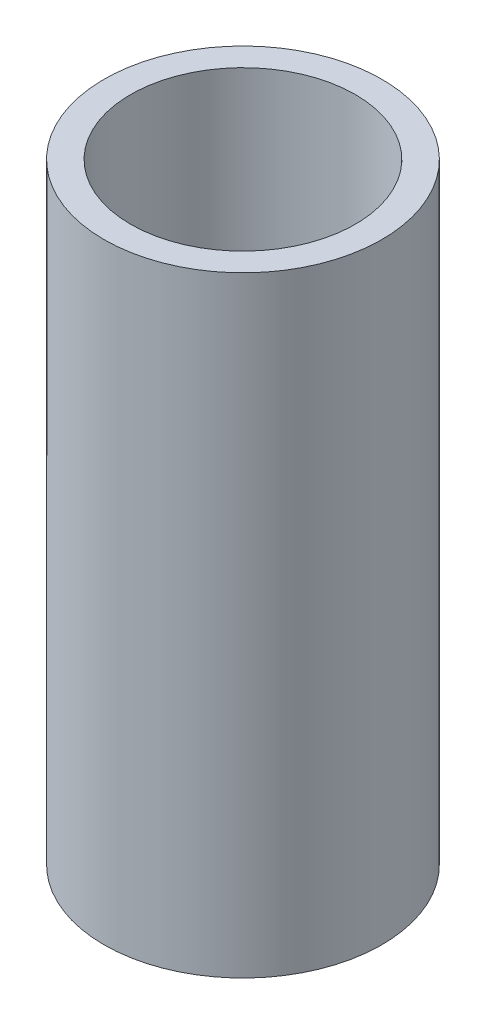
ISO-10303-21;
HEADER;
FILE_DESCRIPTION(('STEP AP214'),'2;1');
FILE_NAME('part.step','',(''),(''),'','','');
FILE_SCHEMA(('AUTOMOTIVE_DESIGN { 1 0 10303 214 1 1 1 1 }'));
ENDSEC;
DATA;
#1=APPLICATION_CONTEXT('core data for automotive mechanical design processes');
#2=APPLICATION_PROTOCOL_DEFINITION('international standard','automotive_design',2000,#1);
#3=PRODUCT_CONTEXT('',#1,'mechanical');
#4=PRODUCT('Part','Part','',(#3));
#5=PRODUCT_RELATED_PRODUCT_CATEGORY('part','',(#4));
#6=PRODUCT_DEFINITION_FORMATION('','',#4);
#7=PRODUCT_DEFINITION_CONTEXT('part definition',#1,'design');
#8=PRODUCT_DEFINITION('design','',#6,#7);
#9=PRODUCT_DEFINITION_SHAPE('','',#8);
#10=(LENGTH_UNIT() NAMED_UNIT(*) SI_UNIT(.MILLI.,.METRE.));
#11=(NAMED_UNIT(*) PLANE_ANGLE_UNIT() SI_UNIT($,.RADIAN.));
#12=(NAMED_UNIT(*) SI_UNIT($,.STERADIAN.) SOLID_ANGLE_UNIT());
#13=UNCERTAINTY_MEASURE_WITH_UNIT(LENGTH_MEASURE(1.E-05),#10,'distance_accuracy_value','');
#14=(GEOMETRIC_REPRESENTATION_CONTEXT(3) GLOBAL_UNCERTAINTY_ASSIGNED_CONTEXT((#13)) GLOBAL_UNIT_ASSIGNED_CONTEXT((#10,
#11,#12)) REPRESENTATION_CONTEXT('',''));
#15=CARTESIAN_POINT('',(0.,0.,0.));
#16=DIRECTION('',(0.,0.,1.));
#17=DIRECTION('',(1.,0.,0.));
#18=AXIS2_PLACEMENT_3D('',#15,#16,#17);
#19=CARTESIAN_POINT('',(0.,152.4,0.));
#20=DIRECTION('',(0.,1.,0.));
#21=DIRECTION('',(0.,0.,1.));
#22=AXIS2_PLACEMENT_3D('',#19,#20,#21);
#23=PLANE('',#22);
#24=CARTESIAN_POINT('',(0.,152.4,0.));
#25=DIRECTION('',(0.,1.,0.));
#26=DIRECTION('',(0.,0.,1.));
#27=AXIS2_PLACEMENT_3D('',#24,#25,#26);
#28=CIRCLE('',#27,34.6583);
#29=CARTESIAN_POINT('',(0.,152.4,34.6583));
#30=VERTEX_POINT('',#29);
#31=EDGE_CURVE('E10',#30,#30,#28,.T.);
#32=ORIENTED_EDGE('',*,*,#31,.T.);
#33=EDGE_LOOP('',(#32));
#34=FACE_BOUND('',#33,.T.);
#35=CARTESIAN_POINT('',(0.,152.4,0.));
#36=DIRECTION('',(0.,1.,0.));
#37=DIRECTION('',(0.,0.,1.));
#38=AXIS2_PLACEMENT_3D('',#35,#36,#37);
#39=CIRCLE('',#38,28.0416);
#40=CARTESIAN_POINT('',(0.,152.4,28.0416));
#41=VERTEX_POINT('',#40);
#42=EDGE_CURVE('E42',#41,#41,#39,.T.);
#43=ORIENTED_EDGE('',*,*,#42,.F.);
#44=EDGE_LOOP('',(#43));
#45=FACE_BOUND('',#44,.T.);
#46=ADVANCED_FACE('F31',(#34,#45),#23,.T.);
#47=CARTESIAN_POINT('',(0.,0.,0.));
#48=DIRECTION('',(0.,1.,0.));
#49=DIRECTION('',(0.,0.,1.));
#50=AXIS2_PLACEMENT_3D('',#47,#48,#49);
#51=PLANE('',#50);
#52=CARTESIAN_POINT('',(0.,0.,0.));
#53=DIRECTION('',(0.,1.,0.));
#54=DIRECTION('',(0.,0.,1.));
#55=AXIS2_PLACEMENT_3D('',#52,#53,#54);
#56=CIRCLE('',#55,34.6583);
#57=CARTESIAN_POINT('',(0.,0.,34.6583));
#58=VERTEX_POINT('',#57);
#59=EDGE_CURVE('E35',#58,#58,#56,.T.);
#60=ORIENTED_EDGE('',*,*,#59,.F.);
#61=EDGE_LOOP('',(#60));
#62=FACE_BOUND('',#61,.T.);
#63=CARTESIAN_POINT('',(0.,0.,0.));
#64=DIRECTION('',(0.,1.,0.));
#65=DIRECTION('',(0.,0.,1.));
#66=AXIS2_PLACEMENT_3D('',#63,#64,#65);
#67=CIRCLE('',#66,28.0416);
#68=CARTESIAN_POINT('',(0.,0.,28.0416));
#69=VERTEX_POINT('',#68);
#70=EDGE_CURVE('E44',#69,#69,#67,.T.);
#71=ORIENTED_EDGE('',*,*,#70,.T.);
#72=EDGE_LOOP('',(#71));
#73=FACE_BOUND('',#72,.T.);
#74=ADVANCED_FACE('F54',(#62,#73),#51,.F.);
#75=CARTESIAN_POINT('',(0.,152.4,0.));
#76=DIRECTION('',(0.,-1.,0.));
#77=DIRECTION('',(0.,0.,-1.));
#78=AXIS2_PLACEMENT_3D('',#75,#76,#77);
#79=CYLINDRICAL_SURFACE('',#78,34.6583);
#80=ORIENTED_EDGE('',*,*,#31,.F.);
#81=EDGE_LOOP('',(#80));
#82=FACE_BOUND('',#81,.T.);
#83=ORIENTED_EDGE('',*,*,#59,.T.);
#84=EDGE_LOOP('',(#83));
#85=FACE_BOUND('',#84,.T.);
#86=ADVANCED_FACE('F33',(#82,#85),#79,.T.);
#87=CARTESIAN_POINT('',(0.,152.4,0.));
#88=DIRECTION('',(0.,-1.,0.));
#89=DIRECTION('',(0.,0.,-1.));
#90=AXIS2_PLACEMENT_3D('',#87,#88,#89);
#91=CYLINDRICAL_SURFACE('',#90,28.0416);
#92=ORIENTED_EDGE('',*,*,#42,.T.);
#93=EDGE_LOOP('',(#92));
#94=FACE_BOUND('',#93,.T.);
#95=ORIENTED_EDGE('',*,*,#70,.F.);
#96=EDGE_LOOP('',(#95));
#97=FACE_BOUND('',#96,.T.);
#98=ADVANCED_FACE('F50',(#94,#97),#91,.F.);
#99=CLOSED_SHELL('',(#46,#74,#86,#98));
#100=MANIFOLD_SOLID_BREP('B2',#99);
#101=ADVANCED_BREP_SHAPE_REPRESENTATION('',(#18,#100),#14);
#102=SHAPE_DEFINITION_REPRESENTATION(#9,#101);
ENDSEC;
END-ISO-10303-21;
